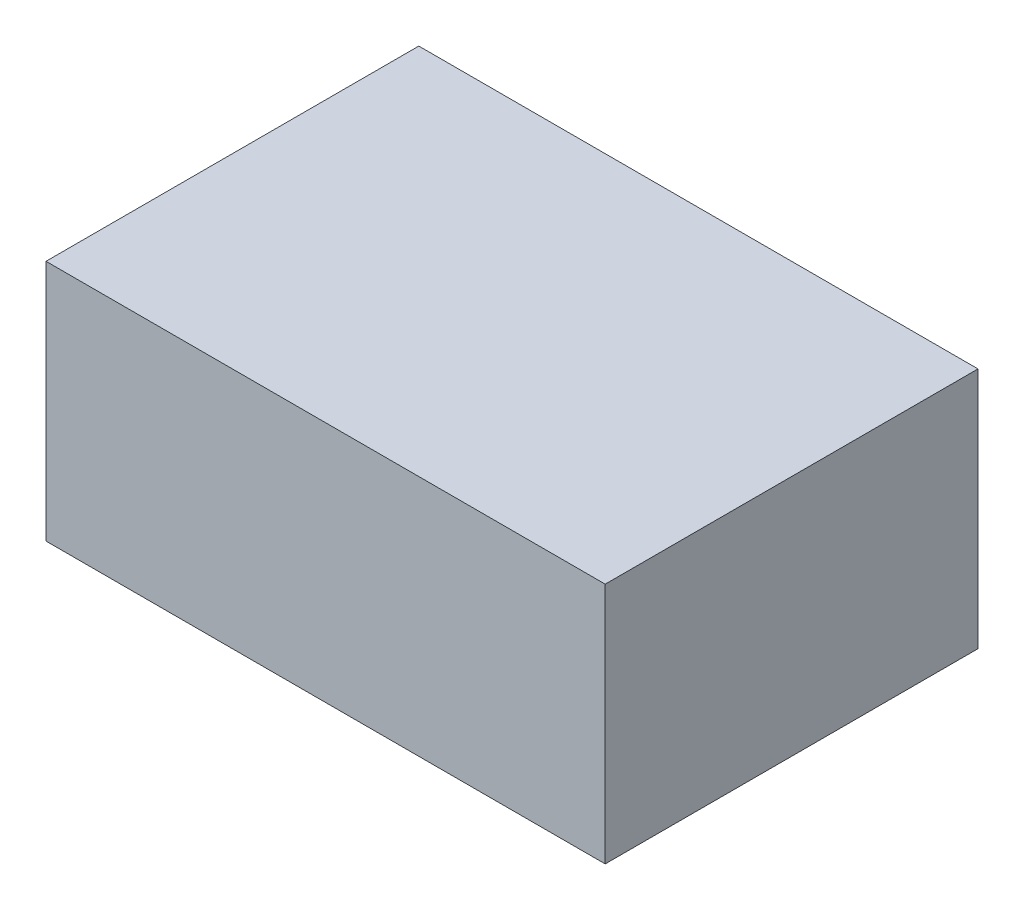
ISO-10303-21;
HEADER;
FILE_DESCRIPTION(('STEP AP214'),'2;1');
FILE_NAME('part.step','',(''),(''),'','','');
FILE_SCHEMA(('AUTOMOTIVE_DESIGN { 1 0 10303 214 1 1 1 1 }'));
ENDSEC;
DATA;
#1=APPLICATION_CONTEXT('core data for automotive mechanical design processes');
#2=APPLICATION_PROTOCOL_DEFINITION('international standard','automotive_design',2000,#1);
#3=PRODUCT_CONTEXT('',#1,'mechanical');
#4=PRODUCT('Part','Part','',(#3));
#5=PRODUCT_RELATED_PRODUCT_CATEGORY('part','',(#4));
#6=PRODUCT_DEFINITION_FORMATION('','',#4);
#7=PRODUCT_DEFINITION_CONTEXT('part definition',#1,'design');
#8=PRODUCT_DEFINITION('design','',#6,#7);
#9=PRODUCT_DEFINITION_SHAPE('','',#8);
#10=(LENGTH_UNIT() NAMED_UNIT(*) SI_UNIT(.MILLI.,.METRE.));
#11=(NAMED_UNIT(*) PLANE_ANGLE_UNIT() SI_UNIT($,.RADIAN.));
#12=(NAMED_UNIT(*) SI_UNIT($,.STERADIAN.) SOLID_ANGLE_UNIT());
#13=UNCERTAINTY_MEASURE_WITH_UNIT(LENGTH_MEASURE(1.E-05),#10,'distance_accuracy_value','');
#14=(GEOMETRIC_REPRESENTATION_CONTEXT(3) GLOBAL_UNCERTAINTY_ASSIGNED_CONTEXT((#13)) GLOBAL_UNIT_ASSIGNED_CONTEXT((#10,
#11,#12)) REPRESENTATION_CONTEXT('',''));
#15=CARTESIAN_POINT('',(0.,0.,0.));
#16=DIRECTION('',(0.,0.,1.));
#17=DIRECTION('',(1.,0.,0.));
#18=AXIS2_PLACEMENT_3D('',#15,#16,#17);
#19=CARTESIAN_POINT('',(-229.133858267717,130.,-172.44094488189));
#20=DIRECTION('',(1.,0.,0.));
#21=DIRECTION('',(0.,0.,-1.));
#22=AXIS2_PLACEMENT_3D('',#19,#20,#21);
#23=PLANE('',#22);
#24=DIRECTION('',(0.,0.,1.));
#25=VECTOR('',#24,1.);
#26=CARTESIAN_POINT('',(-229.133858267717,0.,-172.44094488189));
#27=LINE('',#26,#25);
#28=CARTESIAN_POINT('',(-229.133858267717,0.,-172.44094488189));
#29=VERTEX_POINT('',#28);
#30=CARTESIAN_POINT('',(-229.133858267717,0.,27.5590551181102));
#31=VERTEX_POINT('',#30);
#32=EDGE_CURVE('E107',#29,#31,#27,.T.);
#33=ORIENTED_EDGE('',*,*,#32,.T.);
#34=DIRECTION('',(0.,-1.,0.));
#35=VECTOR('',#34,1.);
#36=CARTESIAN_POINT('',(-229.133858267717,130.,27.5590551181102));
#37=LINE('',#36,#35);
#38=CARTESIAN_POINT('',(-229.133858267717,130.,27.5590551181102));
#39=VERTEX_POINT('',#38);
#40=EDGE_CURVE('E11',#39,#31,#37,.T.);
#41=ORIENTED_EDGE('',*,*,#40,.F.);
#42=DIRECTION('',(0.,0.,1.));
#43=VECTOR('',#42,1.);
#44=CARTESIAN_POINT('',(-229.133858267717,130.,-172.44094488189));
#45=LINE('',#44,#43);
#46=CARTESIAN_POINT('',(-229.133858267717,130.,-172.44094488189));
#47=VERTEX_POINT('',#46);
#48=EDGE_CURVE('E91',#47,#39,#45,.T.);
#49=ORIENTED_EDGE('',*,*,#48,.F.);
#50=DIRECTION('',(0.,-1.,0.));
#51=VECTOR('',#50,1.);
#52=CARTESIAN_POINT('',(-229.133858267717,130.,-172.44094488189));
#53=LINE('',#52,#51);
#54=EDGE_CURVE('E103',#47,#29,#53,.T.);
#55=ORIENTED_EDGE('',*,*,#54,.T.);
#56=EDGE_LOOP('',(#33,#41,#49,#55));
#57=FACE_BOUND('',#56,.T.);
#58=ADVANCED_FACE('F39',(#57),#23,.F.);
#59=CARTESIAN_POINT('',(-229.133858267717,130.,27.5590551181102));
#60=DIRECTION('',(0.,0.,-1.));
#61=DIRECTION('',(-1.,0.,0.));
#62=AXIS2_PLACEMENT_3D('',#59,#60,#61);
#63=PLANE('',#62);
#64=DIRECTION('',(1.,0.,0.));
#65=VECTOR('',#64,1.);
#66=CARTESIAN_POINT('',(-229.133858267717,0.,27.5590551181102));
#67=LINE('',#66,#65);
#68=CARTESIAN_POINT('',(70.8661417322834,0.,27.5590551181102));
#69=VERTEX_POINT('',#68);
#70=EDGE_CURVE('E96',#31,#69,#67,.T.);
#71=ORIENTED_EDGE('',*,*,#70,.T.);
#72=DIRECTION('',(0.,-1.,0.));
#73=VECTOR('',#72,1.);
#74=CARTESIAN_POINT('',(70.8661417322834,130.,27.5590551181102));
#75=LINE('',#74,#73);
#76=CARTESIAN_POINT('',(70.8661417322834,130.,27.5590551181102));
#77=VERTEX_POINT('',#76);
#78=EDGE_CURVE('E48',#77,#69,#75,.T.);
#79=ORIENTED_EDGE('',*,*,#78,.F.);
#80=DIRECTION('',(1.,0.,0.));
#81=VECTOR('',#80,1.);
#82=CARTESIAN_POINT('',(-229.133858267717,130.,27.5590551181102));
#83=LINE('',#82,#81);
#84=EDGE_CURVE('E86',#39,#77,#83,.T.);
#85=ORIENTED_EDGE('',*,*,#84,.F.);
#86=ORIENTED_EDGE('',*,*,#40,.T.);
#87=EDGE_LOOP('',(#71,#79,#85,#86));
#88=FACE_BOUND('',#87,.T.);
#89=ADVANCED_FACE('F95',(#88),#63,.F.);
#90=CARTESIAN_POINT('',(70.8661417322834,130.,-172.44094488189));
#91=DIRECTION('',(-1.,0.,0.));
#92=DIRECTION('',(0.,0.,1.));
#93=AXIS2_PLACEMENT_3D('',#90,#91,#92);
#94=PLANE('',#93);
#95=DIRECTION('',(0.,0.,-1.));
#96=VECTOR('',#95,1.);
#97=CARTESIAN_POINT('',(70.8661417322834,0.,-172.44094488189));
#98=LINE('',#97,#96);
#99=CARTESIAN_POINT('',(70.8661417322834,0.,-172.44094488189));
#100=VERTEX_POINT('',#99);
#101=EDGE_CURVE('E73',#69,#100,#98,.T.);
#102=ORIENTED_EDGE('',*,*,#101,.T.);
#103=DIRECTION('',(0.,-1.,0.));
#104=VECTOR('',#103,1.);
#105=CARTESIAN_POINT('',(70.8661417322834,130.,-172.44094488189));
#106=LINE('',#105,#104);
#107=CARTESIAN_POINT('',(70.8661417322834,130.,-172.44094488189));
#108=VERTEX_POINT('',#107);
#109=EDGE_CURVE('E98',#108,#100,#106,.T.);
#110=ORIENTED_EDGE('',*,*,#109,.F.);
#111=DIRECTION('',(0.,0.,-1.));
#112=VECTOR('',#111,1.);
#113=CARTESIAN_POINT('',(70.8661417322834,130.,-172.44094488189));
#114=LINE('',#113,#112);
#115=EDGE_CURVE('E89',#77,#108,#114,.T.);
#116=ORIENTED_EDGE('',*,*,#115,.F.);
#117=ORIENTED_EDGE('',*,*,#78,.T.);
#118=EDGE_LOOP('',(#102,#110,#116,#117));
#119=FACE_BOUND('',#118,.T.);
#120=ADVANCED_FACE('F99',(#119),#94,.F.);
#121=CARTESIAN_POINT('',(-229.133858267717,130.,-172.44094488189));
#122=DIRECTION('',(0.,0.,1.));
#123=DIRECTION('',(1.,0.,0.));
#124=AXIS2_PLACEMENT_3D('',#121,#122,#123);
#125=PLANE('',#124);
#126=DIRECTION('',(-1.,0.,0.));
#127=VECTOR('',#126,1.);
#128=CARTESIAN_POINT('',(-229.133858267717,0.,-172.44094488189));
#129=LINE('',#128,#127);
#130=EDGE_CURVE('E79',#100,#29,#129,.T.);
#131=ORIENTED_EDGE('',*,*,#130,.T.);
#132=ORIENTED_EDGE('',*,*,#54,.F.);
#133=DIRECTION('',(-1.,0.,0.));
#134=VECTOR('',#133,1.);
#135=CARTESIAN_POINT('',(-229.133858267717,130.,-172.44094488189));
#136=LINE('',#135,#134);
#137=EDGE_CURVE('E56',#108,#47,#136,.T.);
#138=ORIENTED_EDGE('',*,*,#137,.F.);
#139=ORIENTED_EDGE('',*,*,#109,.T.);
#140=EDGE_LOOP('',(#131,#132,#138,#139));
#141=FACE_BOUND('',#140,.T.);
#142=ADVANCED_FACE('F120',(#141),#125,.F.);
#143=CARTESIAN_POINT('',(0.,130.,0.));
#144=DIRECTION('',(0.,1.,0.));
#145=DIRECTION('',(0.,0.,1.));
#146=AXIS2_PLACEMENT_3D('',#143,#144,#145);
#147=PLANE('',#146);
#148=ORIENTED_EDGE('',*,*,#48,.T.);
#149=ORIENTED_EDGE('',*,*,#84,.T.);
#150=ORIENTED_EDGE('',*,*,#115,.T.);
#151=ORIENTED_EDGE('',*,*,#137,.T.);
#152=EDGE_LOOP('',(#148,#149,#150,#151));
#153=FACE_BOUND('',#152,.T.);
#154=ADVANCED_FACE('F87',(#153),#147,.T.);
#155=CARTESIAN_POINT('',(0.,0.,0.));
#156=DIRECTION('',(0.,1.,0.));
#157=DIRECTION('',(0.,0.,1.));
#158=AXIS2_PLACEMENT_3D('',#155,#156,#157);
#159=PLANE('',#158);
#160=ORIENTED_EDGE('',*,*,#32,.F.);
#161=ORIENTED_EDGE('',*,*,#130,.F.);
#162=ORIENTED_EDGE('',*,*,#101,.F.);
#163=ORIENTED_EDGE('',*,*,#70,.F.);
#164=EDGE_LOOP('',(#160,#161,#162,#163));
#165=FACE_BOUND('',#164,.T.);
#166=ADVANCED_FACE('F123',(#165),#159,.F.);
#167=CLOSED_SHELL('',(#58,#89,#120,#142,#154,#166));
#168=MANIFOLD_SOLID_BREP('B2',#167);
#169=ADVANCED_BREP_SHAPE_REPRESENTATION('',(#18,#168),#14);
#170=SHAPE_DEFINITION_REPRESENTATION(#9,#169);
ENDSEC;
END-ISO-10303-21;
